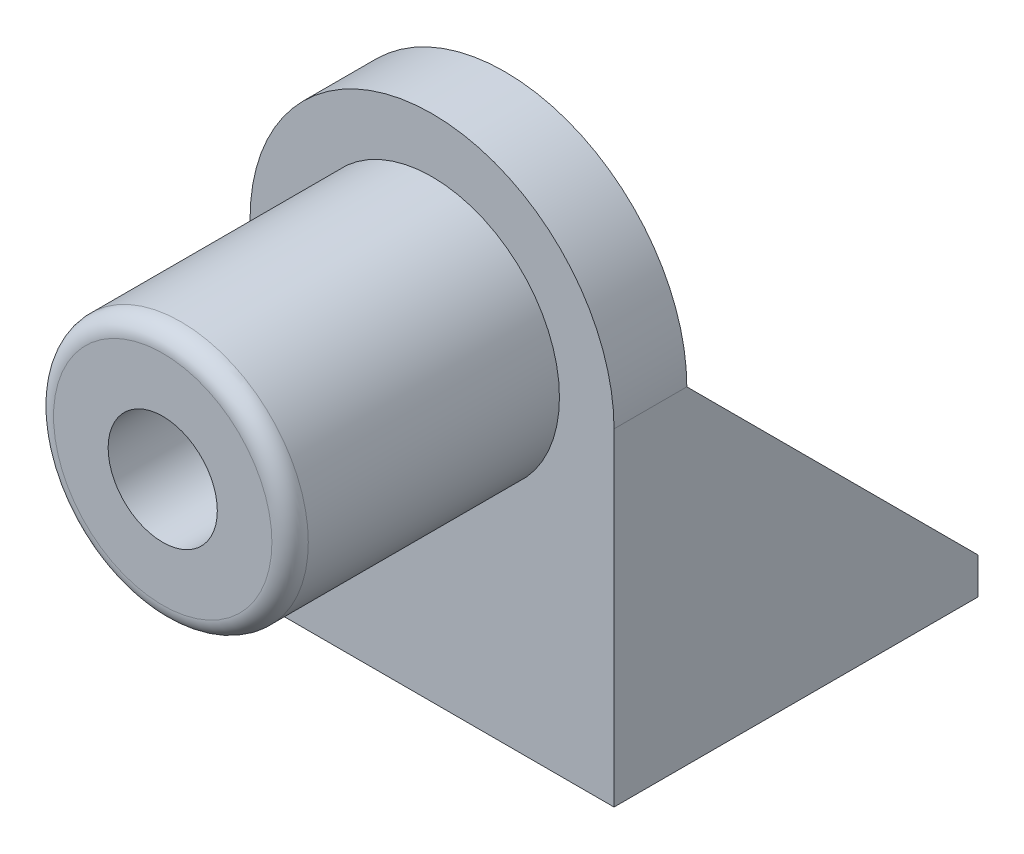
ISO-10303-21;
HEADER;
FILE_DESCRIPTION(('STEP AP214'),'2;1');
FILE_NAME('part.step','',(''),(''),'','','');
FILE_SCHEMA(('AUTOMOTIVE_DESIGN { 1 0 10303 214 1 1 1 1 }'));
ENDSEC;
DATA;
#1=APPLICATION_CONTEXT('core data for automotive mechanical design processes');
#2=APPLICATION_PROTOCOL_DEFINITION('international standard','automotive_design',2000,#1);
#3=PRODUCT_CONTEXT('',#1,'mechanical');
#4=PRODUCT('Part','Part','',(#3));
#5=PRODUCT_RELATED_PRODUCT_CATEGORY('part','',(#4));
#6=PRODUCT_DEFINITION_FORMATION('','',#4);
#7=PRODUCT_DEFINITION_CONTEXT('part definition',#1,'design');
#8=PRODUCT_DEFINITION('design','',#6,#7);
#9=PRODUCT_DEFINITION_SHAPE('','',#8);
#10=(LENGTH_UNIT() NAMED_UNIT(*) SI_UNIT(.MILLI.,.METRE.));
#11=(NAMED_UNIT(*) PLANE_ANGLE_UNIT() SI_UNIT($,.RADIAN.));
#12=(NAMED_UNIT(*) SI_UNIT($,.STERADIAN.) SOLID_ANGLE_UNIT());
#13=UNCERTAINTY_MEASURE_WITH_UNIT(LENGTH_MEASURE(1.E-05),#10,'distance_accuracy_value','');
#14=(GEOMETRIC_REPRESENTATION_CONTEXT(3) GLOBAL_UNCERTAINTY_ASSIGNED_CONTEXT((#13)) GLOBAL_UNIT_ASSIGNED_CONTEXT((#10,
#11,#12)) REPRESENTATION_CONTEXT('',''));
#15=CARTESIAN_POINT('',(0.,0.,0.));
#16=DIRECTION('',(0.,0.,1.));
#17=DIRECTION('',(1.,0.,0.));
#18=AXIS2_PLACEMENT_3D('',#15,#16,#17);
#19=CARTESIAN_POINT('',(15.875,-25.4,-31.75));
#20=DIRECTION('',(0.,-1.,0.));
#21=DIRECTION('',(0.,0.,-1.));
#22=AXIS2_PLACEMENT_3D('',#19,#20,#21);
#23=PLANE('',#22);
#24=CARTESIAN_POINT('',(-9.525,-25.4,-9.525));
#25=DIRECTION('',(0.,1.,0.));
#26=DIRECTION('',(0.,0.,1.));
#27=AXIS2_PLACEMENT_3D('',#24,#25,#26);
#28=CIRCLE('',#27,1.5);
#29=CARTESIAN_POINT('',(-9.525,-25.4,-8.025));
#30=VERTEX_POINT('',#29);
#31=EDGE_CURVE('E310',#30,#30,#28,.T.);
#32=ORIENTED_EDGE('',*,*,#31,.F.);
#33=EDGE_LOOP('',(#32));
#34=FACE_BOUND('',#33,.T.);
#35=CARTESIAN_POINT('',(9.525,-25.4,-9.525));
#36=DIRECTION('',(0.,1.,0.));
#37=DIRECTION('',(0.,0.,1.));
#38=AXIS2_PLACEMENT_3D('',#35,#36,#37);
#39=CIRCLE('',#38,1.5);
#40=CARTESIAN_POINT('',(9.525,-25.4,-8.025));
#41=VERTEX_POINT('',#40);
#42=EDGE_CURVE('E314',#41,#41,#39,.T.);
#43=ORIENTED_EDGE('',*,*,#42,.F.);
#44=EDGE_LOOP('',(#43));
#45=FACE_BOUND('',#44,.T.);
#46=CARTESIAN_POINT('',(9.525,-25.4,-28.575));
#47=DIRECTION('',(0.,1.,0.));
#48=DIRECTION('',(0.,0.,1.));
#49=AXIS2_PLACEMENT_3D('',#46,#47,#48);
#50=CIRCLE('',#49,1.5);
#51=CARTESIAN_POINT('',(9.525,-25.4,-27.075));
#52=VERTEX_POINT('',#51);
#53=EDGE_CURVE('E309',#52,#52,#50,.T.);
#54=ORIENTED_EDGE('',*,*,#53,.F.);
#55=EDGE_LOOP('',(#54));
#56=FACE_BOUND('',#55,.T.);
#57=CARTESIAN_POINT('',(-9.525,-25.4,-28.575));
#58=DIRECTION('',(0.,1.,0.));
#59=DIRECTION('',(0.,0.,1.));
#60=AXIS2_PLACEMENT_3D('',#57,#58,#59);
#61=CIRCLE('',#60,1.5);
#62=CARTESIAN_POINT('',(-9.525,-25.4,-27.075));
#63=VERTEX_POINT('',#62);
#64=EDGE_CURVE('E193',#63,#63,#61,.T.);
#65=ORIENTED_EDGE('',*,*,#64,.F.);
#66=EDGE_LOOP('',(#65));
#67=FACE_BOUND('',#66,.T.);
#68=DIRECTION('',(0.,0.,-1.));
#69=VECTOR('',#68,1.);
#70=CARTESIAN_POINT('',(12.7,-25.4,-6.35));
#71=LINE('',#70,#69);
#72=CARTESIAN_POINT('',(12.7,-25.4,-6.35));
#73=VERTEX_POINT('',#72);
#74=CARTESIAN_POINT('',(12.7,-25.4,-31.75));
#75=VERTEX_POINT('',#74);
#76=EDGE_CURVE('E107',#73,#75,#71,.T.);
#77=ORIENTED_EDGE('',*,*,#76,.T.);
#78=DIRECTION('',(1.,0.,0.));
#79=VECTOR('',#78,1.);
#80=CARTESIAN_POINT('',(15.875,-25.4,-31.75));
#81=LINE('',#80,#79);
#82=CARTESIAN_POINT('',(-12.7,-25.4,-31.75));
#83=VERTEX_POINT('',#82);
#84=EDGE_CURVE('E283',#83,#75,#81,.T.);
#85=ORIENTED_EDGE('',*,*,#84,.F.);
#86=DIRECTION('',(0.,0.,1.));
#87=VECTOR('',#86,1.);
#88=CARTESIAN_POINT('',(-12.7,-25.4,-6.35));
#89=LINE('',#88,#87);
#90=CARTESIAN_POINT('',(-12.7,-25.4,-6.35));
#91=VERTEX_POINT('',#90);
#92=EDGE_CURVE('E131',#83,#91,#89,.T.);
#93=ORIENTED_EDGE('',*,*,#92,.T.);
#94=DIRECTION('',(1.,0.,0.));
#95=VECTOR('',#94,1.);
#96=CARTESIAN_POINT('',(15.875,-25.4,-6.35));
#97=LINE('',#96,#95);
#98=EDGE_CURVE('E125',#91,#73,#97,.T.);
#99=ORIENTED_EDGE('',*,*,#98,.T.);
#100=EDGE_LOOP('',(#77,#85,#93,#99));
#101=FACE_BOUND('',#100,.T.);
#102=ADVANCED_FACE('F39',(#34,#45,#56,#67,#101),#23,.F.);
#103=CARTESIAN_POINT('',(0.,0.,-6.35));
#104=DIRECTION('',(0.,0.,1.));
#105=DIRECTION('',(1.,0.,0.));
#106=AXIS2_PLACEMENT_3D('',#103,#104,#105);
#107=PLANE('',#106);
#108=CARTESIAN_POINT('',(0.,0.,-6.35));
#109=DIRECTION('',(0.,0.,-1.));
#110=DIRECTION('',(-1.,0.,0.));
#111=AXIS2_PLACEMENT_3D('',#108,#109,#110);
#112=CIRCLE('',#111,4.7625);
#113=CARTESIAN_POINT('',(-4.7625,0.,-6.35));
#114=VERTEX_POINT('',#113);
#115=EDGE_CURVE('E147',#114,#114,#112,.T.);
#116=ORIENTED_EDGE('',*,*,#115,.F.);
#117=EDGE_LOOP('',(#116));
#118=FACE_BOUND('',#117,.T.);
#119=CARTESIAN_POINT('',(0.,0.,-6.35));
#120=DIRECTION('',(0.,0.,-1.));
#121=DIRECTION('',(1.,0.,0.));
#122=AXIS2_PLACEMENT_3D('',#119,#120,#121);
#123=CIRCLE('',#122,15.875);
#124=CARTESIAN_POINT('',(-15.875,0.,-6.35));
#125=VERTEX_POINT('',#124);
#126=CARTESIAN_POINT('',(15.875,0.,-6.35));
#127=VERTEX_POINT('',#126);
#128=EDGE_CURVE('E152',#125,#127,#123,.T.);
#129=ORIENTED_EDGE('',*,*,#128,.T.);
#130=DIRECTION('',(1.,0.,0.));
#131=VECTOR('',#130,1.);
#132=CARTESIAN_POINT('',(12.7,0.,-6.35));
#133=LINE('',#132,#131);
#134=CARTESIAN_POINT('',(12.7,0.,-6.35));
#135=VERTEX_POINT('',#134);
#136=EDGE_CURVE('E126',#135,#127,#133,.T.);
#137=ORIENTED_EDGE('',*,*,#136,.F.);
#138=DIRECTION('',(0.,-1.,0.));
#139=VECTOR('',#138,1.);
#140=CARTESIAN_POINT('',(12.7,0.,-6.35));
#141=LINE('',#140,#139);
#142=EDGE_CURVE('E110',#135,#73,#141,.T.);
#143=ORIENTED_EDGE('',*,*,#142,.T.);
#144=ORIENTED_EDGE('',*,*,#98,.F.);
#145=DIRECTION('',(0.,1.,0.));
#146=VECTOR('',#145,1.);
#147=CARTESIAN_POINT('',(-12.7,-25.4,-6.35));
#148=LINE('',#147,#146);
#149=CARTESIAN_POINT('',(-12.7,0.,-6.35));
#150=VERTEX_POINT('',#149);
#151=EDGE_CURVE('E290',#91,#150,#148,.T.);
#152=ORIENTED_EDGE('',*,*,#151,.T.);
#153=DIRECTION('',(-1.,0.,0.));
#154=VECTOR('',#153,1.);
#155=CARTESIAN_POINT('',(-12.7,0.,-6.35));
#156=LINE('',#155,#154);
#157=EDGE_CURVE('E134',#150,#125,#156,.T.);
#158=ORIENTED_EDGE('',*,*,#157,.T.);
#159=EDGE_LOOP('',(#129,#137,#143,#144,#152,#158));
#160=FACE_BOUND('',#159,.T.);
#161=ADVANCED_FACE('F123',(#118,#160),#107,.F.);
#162=CARTESIAN_POINT('',(0.,0.,23.495));
#163=DIRECTION('',(0.,0.,1.));
#164=DIRECTION('',(1.,0.,0.));
#165=AXIS2_PLACEMENT_3D('',#162,#163,#164);
#166=PLANE('',#165);
#167=CARTESIAN_POINT('',(0.,0.,23.495));
#168=DIRECTION('',(0.,0.,1.));
#169=DIRECTION('',(1.,0.,0.));
#170=AXIS2_PLACEMENT_3D('',#167,#168,#169);
#171=CIRCLE('',#170,9.525);
#172=CARTESIAN_POINT('',(9.525,0.,23.495));
#173=VERTEX_POINT('',#172);
#174=EDGE_CURVE('E48',#173,#173,#171,.T.);
#175=ORIENTED_EDGE('',*,*,#174,.T.);
#176=EDGE_LOOP('',(#175));
#177=FACE_BOUND('',#176,.T.);
#178=CARTESIAN_POINT('',(0.,0.,23.495));
#179=DIRECTION('',(0.,0.,1.));
#180=DIRECTION('',(1.,0.,0.));
#181=AXIS2_PLACEMENT_3D('',#178,#179,#180);
#182=CIRCLE('',#181,4.7625);
#183=CARTESIAN_POINT('',(4.7625,0.,23.495));
#184=VERTEX_POINT('',#183);
#185=EDGE_CURVE('E181',#184,#184,#182,.T.);
#186=ORIENTED_EDGE('',*,*,#185,.F.);
#187=EDGE_LOOP('',(#186));
#188=FACE_BOUND('',#187,.T.);
#189=ADVANCED_FACE('F208',(#177,#188),#166,.T.);
#190=CARTESIAN_POINT('',(0.,0.,23.495));
#191=DIRECTION('',(0.,0.,-1.));
#192=DIRECTION('',(-1.,0.,0.));
#193=AXIS2_PLACEMENT_3D('',#190,#191,#192);
#194=CYLINDRICAL_SURFACE('',#193,11.1125);
#195=CARTESIAN_POINT('',(0.,0.,21.9075));
#196=DIRECTION('',(0.,0.,1.));
#197=DIRECTION('',(1.,0.,0.));
#198=AXIS2_PLACEMENT_3D('',#195,#196,#197);
#199=CIRCLE('',#198,11.1125);
#200=CARTESIAN_POINT('',(11.1125,0.,21.9075));
#201=VERTEX_POINT('',#200);
#202=EDGE_CURVE('E11',#201,#201,#199,.F.);
#203=ORIENTED_EDGE('',*,*,#202,.T.);
#204=EDGE_LOOP('',(#203));
#205=FACE_BOUND('',#204,.T.);
#206=CARTESIAN_POINT('',(0.,0.,0.));
#207=DIRECTION('',(0.,0.,1.));
#208=DIRECTION('',(1.,0.,0.));
#209=AXIS2_PLACEMENT_3D('',#206,#207,#208);
#210=CIRCLE('',#209,11.1125);
#211=CARTESIAN_POINT('',(11.1125,0.,0.));
#212=VERTEX_POINT('',#211);
#213=EDGE_CURVE('E180',#212,#212,#210,.T.);
#214=ORIENTED_EDGE('',*,*,#213,.T.);
#215=EDGE_LOOP('',(#214));
#216=FACE_BOUND('',#215,.T.);
#217=ADVANCED_FACE('F257',(#205,#216),#194,.T.);
#218=CARTESIAN_POINT('',(0.,0.,23.495));
#219=DIRECTION('',(0.,0.,-1.));
#220=DIRECTION('',(-1.,0.,0.));
#221=AXIS2_PLACEMENT_3D('',#218,#219,#220);
#222=CYLINDRICAL_SURFACE('',#221,4.7625);
#223=ORIENTED_EDGE('',*,*,#185,.T.);
#224=EDGE_LOOP('',(#223));
#225=FACE_BOUND('',#224,.T.);
#226=ORIENTED_EDGE('',*,*,#115,.T.);
#227=EDGE_LOOP('',(#226));
#228=FACE_BOUND('',#227,.T.);
#229=ADVANCED_FACE('F239',(#225,#228),#222,.F.);
#230=CARTESIAN_POINT('',(0.,0.,0.));
#231=DIRECTION('',(0.,0.,1.));
#232=DIRECTION('',(1.,0.,0.));
#233=AXIS2_PLACEMENT_3D('',#230,#231,#232);
#234=PLANE('',#233);
#235=ORIENTED_EDGE('',*,*,#213,.F.);
#236=EDGE_LOOP('',(#235));
#237=FACE_BOUND('',#236,.T.);
#238=CARTESIAN_POINT('',(0.,0.,0.));
#239=DIRECTION('',(0.,0.,-1.));
#240=DIRECTION('',(1.,0.,0.));
#241=AXIS2_PLACEMENT_3D('',#238,#239,#240);
#242=CIRCLE('',#241,15.875);
#243=CARTESIAN_POINT('',(-15.875,0.,0.));
#244=VERTEX_POINT('',#243);
#245=CARTESIAN_POINT('',(15.875,0.,0.));
#246=VERTEX_POINT('',#245);
#247=EDGE_CURVE('E151',#244,#246,#242,.T.);
#248=ORIENTED_EDGE('',*,*,#247,.F.);
#249=DIRECTION('',(0.,1.,0.));
#250=VECTOR('',#249,1.);
#251=CARTESIAN_POINT('',(-15.875,-28.575,0.));
#252=LINE('',#251,#250);
#253=CARTESIAN_POINT('',(-15.875,-28.575,0.));
#254=VERTEX_POINT('',#253);
#255=EDGE_CURVE('E63',#254,#244,#252,.T.);
#256=ORIENTED_EDGE('',*,*,#255,.F.);
#257=DIRECTION('',(-1.,0.,0.));
#258=VECTOR('',#257,1.);
#259=CARTESIAN_POINT('',(15.875,-28.575,0.));
#260=LINE('',#259,#258);
#261=CARTESIAN_POINT('',(15.875,-28.575,0.));
#262=VERTEX_POINT('',#261);
#263=EDGE_CURVE('E162',#262,#254,#260,.T.);
#264=ORIENTED_EDGE('',*,*,#263,.F.);
#265=DIRECTION('',(0.,-1.,0.));
#266=VECTOR('',#265,1.);
#267=CARTESIAN_POINT('',(15.875,0.,0.));
#268=LINE('',#267,#266);
#269=EDGE_CURVE('E159',#246,#262,#268,.T.);
#270=ORIENTED_EDGE('',*,*,#269,.F.);
#271=EDGE_LOOP('',(#248,#256,#264,#270));
#272=FACE_BOUND('',#271,.T.);
#273=ADVANCED_FACE('F235',(#237,#272),#234,.T.);
#274=CARTESIAN_POINT('',(0.,0.,-6.35));
#275=DIRECTION('',(0.,0.,1.));
#276=DIRECTION('',(1.,0.,0.));
#277=AXIS2_PLACEMENT_3D('',#274,#275,#276);
#278=CYLINDRICAL_SURFACE('',#277,15.875);
#279=ORIENTED_EDGE('',*,*,#247,.T.);
#280=DIRECTION('',(0.,0.,1.));
#281=VECTOR('',#280,1.);
#282=CARTESIAN_POINT('',(15.875,0.,-6.35));
#283=LINE('',#282,#281);
#284=EDGE_CURVE('E176',#127,#246,#283,.T.);
#285=ORIENTED_EDGE('',*,*,#284,.F.);
#286=ORIENTED_EDGE('',*,*,#128,.F.);
#287=DIRECTION('',(0.,0.,1.));
#288=VECTOR('',#287,1.);
#289=CARTESIAN_POINT('',(-15.875,0.,-6.35));
#290=LINE('',#289,#288);
#291=EDGE_CURVE('E155',#125,#244,#290,.T.);
#292=ORIENTED_EDGE('',*,*,#291,.T.);
#293=EDGE_LOOP('',(#279,#285,#286,#292));
#294=FACE_BOUND('',#293,.T.);
#295=ADVANCED_FACE('F238',(#294),#278,.T.);
#296=CARTESIAN_POINT('',(15.875,0.,-6.35));
#297=DIRECTION('',(-1.,0.,0.));
#298=DIRECTION('',(0.,0.,1.));
#299=AXIS2_PLACEMENT_3D('',#296,#297,#298);
#300=PLANE('',#299);
#301=ORIENTED_EDGE('',*,*,#269,.T.);
#302=DIRECTION('',(0.,0.,1.));
#303=VECTOR('',#302,1.);
#304=CARTESIAN_POINT('',(15.875,-28.575,-6.35));
#305=LINE('',#304,#303);
#306=CARTESIAN_POINT('',(15.875,-28.575,-31.75));
#307=VERTEX_POINT('',#306);
#308=EDGE_CURVE('E172',#307,#262,#305,.T.);
#309=ORIENTED_EDGE('',*,*,#308,.F.);
#310=DIRECTION('',(0.,-1.,0.));
#311=VECTOR('',#310,1.);
#312=CARTESIAN_POINT('',(15.875,-28.575,-31.75));
#313=LINE('',#312,#311);
#314=CARTESIAN_POINT('',(15.875,-25.4,-31.75));
#315=VERTEX_POINT('',#314);
#316=EDGE_CURVE('E133',#315,#307,#313,.T.);
#317=ORIENTED_EDGE('',*,*,#316,.F.);
#318=DIRECTION('',(0.,0.707106781186547,0.707106781186548));
#319=VECTOR('',#318,1.);
#320=CARTESIAN_POINT('',(15.875,-25.4,-31.75));
#321=LINE('',#320,#319);
#322=EDGE_CURVE('E128',#315,#127,#321,.T.);
#323=ORIENTED_EDGE('',*,*,#322,.T.);
#324=ORIENTED_EDGE('',*,*,#284,.T.);
#325=EDGE_LOOP('',(#301,#309,#317,#323,#324));
#326=FACE_BOUND('',#325,.T.);
#327=ADVANCED_FACE('F247',(#326),#300,.F.);
#328=CARTESIAN_POINT('',(15.875,-28.575,-6.35));
#329=DIRECTION('',(0.,1.,0.));
#330=DIRECTION('',(0.,0.,1.));
#331=AXIS2_PLACEMENT_3D('',#328,#329,#330);
#332=PLANE('',#331);
#333=CARTESIAN_POINT('',(-9.525,-28.575,-9.525));
#334=DIRECTION('',(0.,1.,0.));
#335=DIRECTION('',(0.,0.,1.));
#336=AXIS2_PLACEMENT_3D('',#333,#334,#335);
#337=CIRCLE('',#336,1.5);
#338=CARTESIAN_POINT('',(-9.525,-28.575,-8.025));
#339=VERTEX_POINT('',#338);
#340=EDGE_CURVE('E201',#339,#339,#337,.T.);
#341=ORIENTED_EDGE('',*,*,#340,.T.);
#342=EDGE_LOOP('',(#341));
#343=FACE_BOUND('',#342,.T.);
#344=CARTESIAN_POINT('',(9.525,-28.575,-9.525));
#345=DIRECTION('',(0.,1.,0.));
#346=DIRECTION('',(0.,0.,1.));
#347=AXIS2_PLACEMENT_3D('',#344,#345,#346);
#348=CIRCLE('',#347,1.5);
#349=CARTESIAN_POINT('',(9.525,-28.575,-8.025));
#350=VERTEX_POINT('',#349);
#351=EDGE_CURVE('E197',#350,#350,#348,.T.);
#352=ORIENTED_EDGE('',*,*,#351,.T.);
#353=EDGE_LOOP('',(#352));
#354=FACE_BOUND('',#353,.T.);
#355=CARTESIAN_POINT('',(9.525,-28.575,-28.575));
#356=DIRECTION('',(0.,1.,0.));
#357=DIRECTION('',(0.,0.,1.));
#358=AXIS2_PLACEMENT_3D('',#355,#356,#357);
#359=CIRCLE('',#358,1.5);
#360=CARTESIAN_POINT('',(9.525,-28.575,-27.075));
#361=VERTEX_POINT('',#360);
#362=EDGE_CURVE('E192',#361,#361,#359,.T.);
#363=ORIENTED_EDGE('',*,*,#362,.T.);
#364=EDGE_LOOP('',(#363));
#365=FACE_BOUND('',#364,.T.);
#366=CARTESIAN_POINT('',(-9.525,-28.575,-28.575));
#367=DIRECTION('',(0.,1.,0.));
#368=DIRECTION('',(0.,0.,1.));
#369=AXIS2_PLACEMENT_3D('',#366,#367,#368);
#370=CIRCLE('',#369,1.5);
#371=CARTESIAN_POINT('',(-9.525,-28.575,-27.075));
#372=VERTEX_POINT('',#371);
#373=EDGE_CURVE('E188',#372,#372,#370,.T.);
#374=ORIENTED_EDGE('',*,*,#373,.T.);
#375=EDGE_LOOP('',(#374));
#376=FACE_BOUND('',#375,.T.);
#377=ORIENTED_EDGE('',*,*,#263,.T.);
#378=DIRECTION('',(0.,0.,1.));
#379=VECTOR('',#378,1.);
#380=CARTESIAN_POINT('',(-15.875,-28.575,-6.35));
#381=LINE('',#380,#379);
#382=CARTESIAN_POINT('',(-15.875,-28.575,-31.75));
#383=VERTEX_POINT('',#382);
#384=EDGE_CURVE('E169',#383,#254,#381,.T.);
#385=ORIENTED_EDGE('',*,*,#384,.F.);
#386=DIRECTION('',(-1.,0.,0.));
#387=VECTOR('',#386,1.);
#388=CARTESIAN_POINT('',(15.875,-28.575,-31.75));
#389=LINE('',#388,#387);
#390=EDGE_CURVE('E139',#307,#383,#389,.T.);
#391=ORIENTED_EDGE('',*,*,#390,.F.);
#392=ORIENTED_EDGE('',*,*,#308,.T.);
#393=EDGE_LOOP('',(#377,#385,#391,#392));
#394=FACE_BOUND('',#393,.T.);
#395=ADVANCED_FACE('F244',(#343,#354,#365,#376,#394),#332,.F.);
#396=CARTESIAN_POINT('',(-15.875,-28.575,-6.35));
#397=DIRECTION('',(1.,0.,0.));
#398=DIRECTION('',(0.,1.,0.));
#399=AXIS2_PLACEMENT_3D('',#396,#397,#398);
#400=PLANE('',#399);
#401=ORIENTED_EDGE('',*,*,#291,.F.);
#402=DIRECTION('',(0.,-0.707106781186548,-0.707106781186547));
#403=VECTOR('',#402,1.);
#404=CARTESIAN_POINT('',(-15.875,-25.4,-31.75));
#405=LINE('',#404,#403);
#406=CARTESIAN_POINT('',(-15.875,-25.4,-31.75));
#407=VERTEX_POINT('',#406);
#408=EDGE_CURVE('E273',#125,#407,#405,.T.);
#409=ORIENTED_EDGE('',*,*,#408,.T.);
#410=DIRECTION('',(0.,1.,0.));
#411=VECTOR('',#410,1.);
#412=CARTESIAN_POINT('',(-15.875,-28.575,-31.75));
#413=LINE('',#412,#411);
#414=EDGE_CURVE('E275',#383,#407,#413,.T.);
#415=ORIENTED_EDGE('',*,*,#414,.F.);
#416=ORIENTED_EDGE('',*,*,#384,.T.);
#417=ORIENTED_EDGE('',*,*,#255,.T.);
#418=EDGE_LOOP('',(#401,#409,#415,#416,#417));
#419=FACE_BOUND('',#418,.T.);
#420=ADVANCED_FACE('F241',(#419),#400,.F.);
#421=CARTESIAN_POINT('',(0.,0.,-31.75));
#422=DIRECTION('',(0.,0.,1.));
#423=DIRECTION('',(1.,0.,0.));
#424=AXIS2_PLACEMENT_3D('',#421,#422,#423);
#425=PLANE('',#424);
#426=ORIENTED_EDGE('',*,*,#316,.T.);
#427=ORIENTED_EDGE('',*,*,#390,.T.);
#428=ORIENTED_EDGE('',*,*,#414,.T.);
#429=EDGE_CURVE('E145',#407,#83,#81,.T.);
#430=ORIENTED_EDGE('',*,*,#429,.T.);
#431=ORIENTED_EDGE('',*,*,#84,.T.);
#432=DIRECTION('',(1.,0.,0.));
#433=VECTOR('',#432,1.);
#434=CARTESIAN_POINT('',(12.7,-25.4,-31.75));
#435=LINE('',#434,#433);
#436=EDGE_CURVE('E295',#75,#315,#435,.T.);
#437=ORIENTED_EDGE('',*,*,#436,.T.);
#438=EDGE_LOOP('',(#426,#427,#428,#430,#431,#437));
#439=FACE_BOUND('',#438,.T.);
#440=ADVANCED_FACE('F232',(#439),#425,.F.);
#441=CARTESIAN_POINT('',(-12.7,-25.4,-31.75));
#442=DIRECTION('',(0.,0.707106781186547,-0.707106781186548));
#443=DIRECTION('',(0.,0.707106781186548,0.707106781186547));
#444=AXIS2_PLACEMENT_3D('',#441,#442,#443);
#445=PLANE('',#444);
#446=ORIENTED_EDGE('',*,*,#408,.F.);
#447=ORIENTED_EDGE('',*,*,#157,.F.);
#448=DIRECTION('',(0.,-0.707106781186548,-0.707106781186547));
#449=VECTOR('',#448,1.);
#450=CARTESIAN_POINT('',(-12.7,-25.4,-31.75));
#451=LINE('',#450,#449);
#452=EDGE_CURVE('E55',#150,#83,#451,.T.);
#453=ORIENTED_EDGE('',*,*,#452,.T.);
#454=ORIENTED_EDGE('',*,*,#429,.F.);
#455=EDGE_LOOP('',(#446,#447,#453,#454));
#456=FACE_BOUND('',#455,.T.);
#457=ADVANCED_FACE('F337',(#456),#445,.T.);
#458=CARTESIAN_POINT('',(-12.7,0.,0.));
#459=DIRECTION('',(1.,0.,0.));
#460=DIRECTION('',(0.,1.,0.));
#461=AXIS2_PLACEMENT_3D('',#458,#459,#460);
#462=PLANE('',#461);
#463=ORIENTED_EDGE('',*,*,#92,.F.);
#464=ORIENTED_EDGE('',*,*,#452,.F.);
#465=ORIENTED_EDGE('',*,*,#151,.F.);
#466=EDGE_LOOP('',(#463,#464,#465));
#467=FACE_BOUND('',#466,.T.);
#468=ADVANCED_FACE('F339',(#467),#462,.T.);
#469=CARTESIAN_POINT('',(12.7,-25.4,-31.75));
#470=DIRECTION('',(0.,0.707106781186548,-0.707106781186547));
#471=DIRECTION('',(0.,0.707106781186547,0.707106781186548));
#472=AXIS2_PLACEMENT_3D('',#469,#470,#471);
#473=PLANE('',#472);
#474=ORIENTED_EDGE('',*,*,#322,.F.);
#475=ORIENTED_EDGE('',*,*,#436,.F.);
#476=DIRECTION('',(0.,0.707106781186547,0.707106781186548));
#477=VECTOR('',#476,1.);
#478=CARTESIAN_POINT('',(12.7,-25.4,-31.75));
#479=LINE('',#478,#477);
#480=EDGE_CURVE('E112',#75,#135,#479,.T.);
#481=ORIENTED_EDGE('',*,*,#480,.T.);
#482=ORIENTED_EDGE('',*,*,#136,.T.);
#483=EDGE_LOOP('',(#474,#475,#481,#482));
#484=FACE_BOUND('',#483,.T.);
#485=ADVANCED_FACE('F340',(#484),#473,.T.);
#486=CARTESIAN_POINT('',(12.7,0.,0.));
#487=DIRECTION('',(1.,0.,0.));
#488=DIRECTION('',(0.,1.,0.));
#489=AXIS2_PLACEMENT_3D('',#486,#487,#488);
#490=PLANE('',#489);
#491=ORIENTED_EDGE('',*,*,#142,.F.);
#492=ORIENTED_EDGE('',*,*,#480,.F.);
#493=ORIENTED_EDGE('',*,*,#76,.F.);
#494=EDGE_LOOP('',(#491,#492,#493));
#495=FACE_BOUND('',#494,.T.);
#496=ADVANCED_FACE('F109',(#495),#490,.F.);
#497=CARTESIAN_POINT('',(-9.525,-37.719,-28.575));
#498=DIRECTION('',(0.,1.,0.));
#499=DIRECTION('',(0.,0.,1.));
#500=AXIS2_PLACEMENT_3D('',#497,#498,#499);
#501=CYLINDRICAL_SURFACE('',#500,1.5);
#502=ORIENTED_EDGE('',*,*,#64,.T.);
#503=EDGE_LOOP('',(#502));
#504=FACE_BOUND('',#503,.T.);
#505=ORIENTED_EDGE('',*,*,#373,.F.);
#506=EDGE_LOOP('',(#505));
#507=FACE_BOUND('',#506,.T.);
#508=ADVANCED_FACE('F328',(#504,#507),#501,.F.);
#509=CARTESIAN_POINT('',(9.525,-37.719,-28.575));
#510=DIRECTION('',(0.,1.,0.));
#511=DIRECTION('',(0.,0.,1.));
#512=AXIS2_PLACEMENT_3D('',#509,#510,#511);
#513=CYLINDRICAL_SURFACE('',#512,1.5);
#514=ORIENTED_EDGE('',*,*,#53,.T.);
#515=EDGE_LOOP('',(#514));
#516=FACE_BOUND('',#515,.T.);
#517=ORIENTED_EDGE('',*,*,#362,.F.);
#518=EDGE_LOOP('',(#517));
#519=FACE_BOUND('',#518,.T.);
#520=ADVANCED_FACE('F322',(#516,#519),#513,.F.);
#521=CARTESIAN_POINT('',(9.525,-37.719,-9.525));
#522=DIRECTION('',(0.,1.,0.));
#523=DIRECTION('',(0.,0.,1.));
#524=AXIS2_PLACEMENT_3D('',#521,#522,#523);
#525=CYLINDRICAL_SURFACE('',#524,1.5);
#526=ORIENTED_EDGE('',*,*,#42,.T.);
#527=EDGE_LOOP('',(#526));
#528=FACE_BOUND('',#527,.T.);
#529=ORIENTED_EDGE('',*,*,#351,.F.);
#530=EDGE_LOOP('',(#529));
#531=FACE_BOUND('',#530,.T.);
#532=ADVANCED_FACE('F217',(#528,#531),#525,.F.);
#533=CARTESIAN_POINT('',(-9.525,-37.719,-9.525));
#534=DIRECTION('',(0.,1.,0.));
#535=DIRECTION('',(0.,0.,1.));
#536=AXIS2_PLACEMENT_3D('',#533,#534,#535);
#537=CYLINDRICAL_SURFACE('',#536,1.5);
#538=ORIENTED_EDGE('',*,*,#31,.T.);
#539=EDGE_LOOP('',(#538));
#540=FACE_BOUND('',#539,.T.);
#541=ORIENTED_EDGE('',*,*,#340,.F.);
#542=EDGE_LOOP('',(#541));
#543=FACE_BOUND('',#542,.T.);
#544=ADVANCED_FACE('F212',(#540,#543),#537,.F.);
#545=CARTESIAN_POINT('',(0.,0.,21.9075));
#546=DIRECTION('',(0.,0.,1.));
#547=DIRECTION('',(1.,0.,0.));
#548=AXIS2_PLACEMENT_3D('',#545,#546,#547);
#549=TOROIDAL_SURFACE('',#548,9.525,1.5875);
#550=ORIENTED_EDGE('',*,*,#202,.F.);
#551=EDGE_LOOP('',(#550));
#552=FACE_BOUND('',#551,.T.);
#553=ORIENTED_EDGE('',*,*,#174,.F.);
#554=EDGE_LOOP('',(#553));
#555=FACE_BOUND('',#554,.T.);
#556=ADVANCED_FACE('F41',(#552,#555),#549,.T.);
#557=CLOSED_SHELL('',(#102,#161,#189,#217,#229,#273,#295,#327,#395,#420,#440,#457,#468,#485,
#496,#508,#520,#532,#544,#556));
#558=MANIFOLD_SOLID_BREP('B2',#557);
#559=ADVANCED_BREP_SHAPE_REPRESENTATION('',(#18,#558),#14);
#560=SHAPE_DEFINITION_REPRESENTATION(#9,#559);
ENDSEC;
END-ISO-10303-21;
